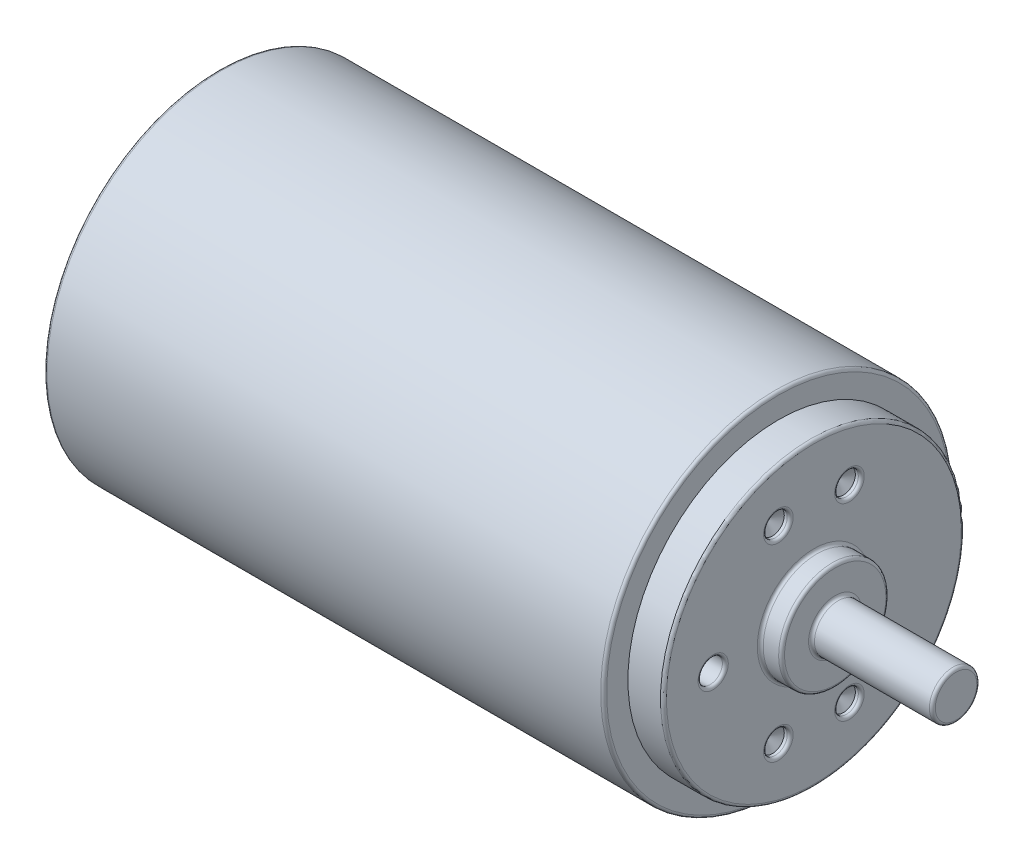
ISO-10303-21;
HEADER;
FILE_DESCRIPTION(('STEP AP214'),'2;1');
FILE_NAME('part.step','',(''),(''),'','','');
FILE_SCHEMA(('AUTOMOTIVE_DESIGN { 1 0 10303 214 1 1 1 1 }'));
ENDSEC;
DATA;
#1=APPLICATION_CONTEXT('core data for automotive mechanical design processes');
#2=APPLICATION_PROTOCOL_DEFINITION('international standard','automotive_design',2000,#1);
#3=PRODUCT_CONTEXT('',#1,'mechanical');
#4=PRODUCT('Part','Part','',(#3));
#5=PRODUCT_RELATED_PRODUCT_CATEGORY('part','',(#4));
#6=PRODUCT_DEFINITION_FORMATION('','',#4);
#7=PRODUCT_DEFINITION_CONTEXT('part definition',#1,'design');
#8=PRODUCT_DEFINITION('design','',#6,#7);
#9=PRODUCT_DEFINITION_SHAPE('','',#8);
#10=(LENGTH_UNIT() NAMED_UNIT(*) SI_UNIT(.MILLI.,.METRE.));
#11=(NAMED_UNIT(*) PLANE_ANGLE_UNIT() SI_UNIT($,.RADIAN.));
#12=(NAMED_UNIT(*) SI_UNIT($,.STERADIAN.) SOLID_ANGLE_UNIT());
#13=UNCERTAINTY_MEASURE_WITH_UNIT(LENGTH_MEASURE(1.E-05),#10,'distance_accuracy_value','');
#14=(GEOMETRIC_REPRESENTATION_CONTEXT(3) GLOBAL_UNCERTAINTY_ASSIGNED_CONTEXT((#13)) GLOBAL_UNIT_ASSIGNED_CONTEXT((#10,
#11,#12)) REPRESENTATION_CONTEXT('',''));
#15=CARTESIAN_POINT('',(0.,0.,0.));
#16=DIRECTION('',(0.,0.,1.));
#17=DIRECTION('',(1.,0.,0.));
#18=AXIS2_PLACEMENT_3D('',#15,#16,#17);
#19=CARTESIAN_POINT('',(-21.6511204199663,29.5,0.));
#20=DIRECTION('',(-1.,0.,0.));
#21=DIRECTION('',(0.,-1.,0.));
#22=AXIS2_PLACEMENT_3D('',#19,#20,#21);
#23=PLANE('',#22);
#24=CARTESIAN_POINT('',(-21.6511204199663,0.,0.));
#25=DIRECTION('',(-1.,0.,0.));
#26=DIRECTION('',(0.,-1.,0.));
#27=AXIS2_PLACEMENT_3D('',#24,#25,#26);
#28=CIRCLE('',#27,23.4496818018802);
#29=CARTESIAN_POINT('',(-21.6511204199663,-23.4496818018802,0.));
#30=VERTEX_POINT('',#29);
#31=EDGE_CURVE('E173',#30,#30,#28,.F.);
#32=ORIENTED_EDGE('',*,*,#31,.T.);
#33=EDGE_LOOP('',(#32));
#34=FACE_BOUND('',#33,.T.);
#35=CARTESIAN_POINT('',(-21.6511204199663,0.,0.));
#36=DIRECTION('',(-1.,0.,0.));
#37=DIRECTION('',(0.,-1.,0.));
#38=AXIS2_PLACEMENT_3D('',#35,#36,#37);
#39=CIRCLE('',#38,29.);
#40=CARTESIAN_POINT('',(-21.6511204199663,-29.,0.));
#41=VERTEX_POINT('',#40);
#42=EDGE_CURVE('E170',#41,#41,#39,.T.);
#43=ORIENTED_EDGE('',*,*,#42,.T.);
#44=EDGE_LOOP('',(#43));
#45=FACE_BOUND('',#44,.T.);
#46=ADVANCED_FACE('F41',(#34,#45),#23,.T.);
#47=CARTESIAN_POINT('',(0.,0.,0.));
#48=DIRECTION('',(1.,0.,0.));
#49=DIRECTION('',(0.,1.,0.));
#50=AXIS2_PLACEMENT_3D('',#47,#48,#49);
#51=CYLINDRICAL_SURFACE('',#50,22.9496818018802);
#52=CARTESIAN_POINT('',(-23.6911519728795,0.,0.));
#53=DIRECTION('',(-1.,0.,0.));
#54=DIRECTION('',(0.,-1.,0.));
#55=AXIS2_PLACEMENT_3D('',#52,#53,#54);
#56=CIRCLE('',#55,22.9496818018802);
#57=CARTESIAN_POINT('',(-23.6911519728795,-22.9496818018802,0.));
#58=VERTEX_POINT('',#57);
#59=EDGE_CURVE('E164',#58,#58,#56,.F.);
#60=ORIENTED_EDGE('',*,*,#59,.T.);
#61=EDGE_LOOP('',(#60));
#62=FACE_BOUND('',#61,.T.);
#63=CARTESIAN_POINT('',(-22.1511204199663,0.,0.));
#64=DIRECTION('',(-1.,0.,0.));
#65=DIRECTION('',(0.,-1.,0.));
#66=AXIS2_PLACEMENT_3D('',#63,#64,#65);
#67=CIRCLE('',#66,22.9496818018802);
#68=CARTESIAN_POINT('',(-22.1511204199663,-22.9496818018802,0.));
#69=VERTEX_POINT('',#68);
#70=EDGE_CURVE('E161',#69,#69,#67,.T.);
#71=ORIENTED_EDGE('',*,*,#70,.T.);
#72=EDGE_LOOP('',(#71));
#73=FACE_BOUND('',#72,.T.);
#74=ADVANCED_FACE('F200',(#62,#73),#51,.T.);
#75=CARTESIAN_POINT('',(-24.1911519728795,22.9496818018802,0.));
#76=DIRECTION('',(-1.,0.,0.));
#77=DIRECTION('',(0.,-1.,0.));
#78=AXIS2_PLACEMENT_3D('',#75,#76,#77);
#79=PLANE('',#78);
#80=CARTESIAN_POINT('',(-24.1911519728795,0.,0.));
#81=DIRECTION('',(-1.,0.,0.));
#82=DIRECTION('',(0.,-1.,0.));
#83=AXIS2_PLACEMENT_3D('',#80,#81,#82);
#84=CIRCLE('',#83,22.4496818018802);
#85=CARTESIAN_POINT('',(-24.1911519728795,-22.4496818018802,0.));
#86=VERTEX_POINT('',#85);
#87=EDGE_CURVE('E167',#86,#86,#84,.T.);
#88=ORIENTED_EDGE('',*,*,#87,.T.);
#89=EDGE_LOOP('',(#88));
#90=FACE_BOUND('',#89,.T.);
#91=CARTESIAN_POINT('',(-24.1911519728795,0.,0.));
#92=DIRECTION('',(1.,0.,0.));
#93=DIRECTION('',(0.,1.,0.));
#94=AXIS2_PLACEMENT_3D('',#91,#92,#93);
#95=CIRCLE('',#94,5.69335436860877);
#96=CARTESIAN_POINT('',(-24.1911519728795,5.69335436860877,0.));
#97=VERTEX_POINT('',#96);
#98=EDGE_CURVE('E95',#97,#97,#95,.T.);
#99=ORIENTED_EDGE('',*,*,#98,.T.);
#100=EDGE_LOOP('',(#99));
#101=FACE_BOUND('',#100,.T.);
#102=ADVANCED_FACE('F207',(#90,#101),#79,.T.);
#103=CARTESIAN_POINT('',(-24.1911519728795,0.,0.));
#104=DIRECTION('',(1.,0.,0.));
#105=DIRECTION('',(0.,1.,0.));
#106=AXIS2_PLACEMENT_3D('',#103,#104,#105);
#107=CONICAL_SURFACE('',#106,5.69335436860877,0.275071425127153);
#108=CARTESIAN_POINT('',(-30.1911519728795,0.,0.));
#109=DIRECTION('',(1.,0.,0.));
#110=DIRECTION('',(0.,1.,0.));
#111=AXIS2_PLACEMENT_3D('',#108,#109,#110);
#112=CIRCLE('',#111,4.);
#113=CARTESIAN_POINT('',(-30.1911519728795,4.,0.));
#114=VERTEX_POINT('',#113);
#115=EDGE_CURVE('E92',#114,#114,#112,.T.);
#116=ORIENTED_EDGE('',*,*,#115,.T.);
#117=EDGE_LOOP('',(#116));
#118=FACE_BOUND('',#117,.T.);
#119=ORIENTED_EDGE('',*,*,#98,.F.);
#120=EDGE_LOOP('',(#119));
#121=FACE_BOUND('',#120,.T.);
#122=ADVANCED_FACE('F518',(#118,#121),#107,.T.);
#123=CARTESIAN_POINT('',(0.,0.,0.));
#124=DIRECTION('',(1.,0.,0.));
#125=DIRECTION('',(0.,1.,0.));
#126=AXIS2_PLACEMENT_3D('',#123,#124,#125);
#127=CYLINDRICAL_SURFACE('',#126,4.);
#128=CARTESIAN_POINT('',(-38.6911519728795,0.,0.));
#129=DIRECTION('',(-1.,0.,0.));
#130=DIRECTION('',(0.,-1.,0.));
#131=AXIS2_PLACEMENT_3D('',#128,#129,#130);
#132=CIRCLE('',#131,4.);
#133=CARTESIAN_POINT('',(-38.6911519728795,-4.,0.));
#134=VERTEX_POINT('',#133);
#135=EDGE_CURVE('E155',#134,#134,#132,.F.);
#136=ORIENTED_EDGE('',*,*,#135,.T.);
#137=EDGE_LOOP('',(#136));
#138=FACE_BOUND('',#137,.T.);
#139=ORIENTED_EDGE('',*,*,#115,.F.);
#140=EDGE_LOOP('',(#139));
#141=FACE_BOUND('',#140,.T.);
#142=ADVANCED_FACE('F508',(#138,#141),#127,.T.);
#143=CARTESIAN_POINT('',(-39.1911519728795,4.,0.));
#144=DIRECTION('',(-1.,0.,0.));
#145=DIRECTION('',(0.,-1.,0.));
#146=AXIS2_PLACEMENT_3D('',#143,#144,#145);
#147=PLANE('',#146);
#148=CARTESIAN_POINT('',(-39.1911519728795,0.,0.));
#149=DIRECTION('',(-1.,0.,0.));
#150=DIRECTION('',(0.,-1.,0.));
#151=AXIS2_PLACEMENT_3D('',#148,#149,#150);
#152=CIRCLE('',#151,3.5);
#153=CARTESIAN_POINT('',(-39.1911519728795,-3.5,0.));
#154=VERTEX_POINT('',#153);
#155=EDGE_CURVE('E158',#154,#154,#152,.T.);
#156=ORIENTED_EDGE('',*,*,#155,.T.);
#157=EDGE_LOOP('',(#156));
#158=FACE_BOUND('',#157,.T.);
#159=ADVANCED_FACE('F499',(#158),#147,.T.);
#160=CARTESIAN_POINT('',(102.808848027121,4.,0.));
#161=DIRECTION('',(1.,0.,0.));
#162=DIRECTION('',(0.,1.,0.));
#163=AXIS2_PLACEMENT_3D('',#160,#161,#162);
#164=PLANE('',#163);
#165=CARTESIAN_POINT('',(102.808848027121,0.,0.));
#166=DIRECTION('',(1.,0.,0.));
#167=DIRECTION('',(0.,1.,0.));
#168=AXIS2_PLACEMENT_3D('',#165,#166,#167);
#169=CIRCLE('',#168,3.49999999999999);
#170=CARTESIAN_POINT('',(102.808848027121,3.5,0.));
#171=VERTEX_POINT('',#170);
#172=EDGE_CURVE('E49',#171,#171,#169,.T.);
#173=ORIENTED_EDGE('',*,*,#172,.T.);
#174=EDGE_LOOP('',(#173));
#175=FACE_BOUND('',#174,.T.);
#176=ADVANCED_FACE('F184',(#175),#164,.T.);
#177=CARTESIAN_POINT('',(0.,0.,0.));
#178=DIRECTION('',(1.,0.,0.));
#179=DIRECTION('',(0.,1.,0.));
#180=AXIS2_PLACEMENT_3D('',#177,#178,#179);
#181=CYLINDRICAL_SURFACE('',#180,3.99999999999999);
#182=CARTESIAN_POINT('',(82.9088480271205,0.,0.));
#183=DIRECTION('',(1.,0.,0.));
#184=DIRECTION('',(0.,1.,0.));
#185=AXIS2_PLACEMENT_3D('',#182,#183,#184);
#186=CIRCLE('',#185,3.99999999999999);
#187=CARTESIAN_POINT('',(82.9088480271205,4.,0.));
#188=VERTEX_POINT('',#187);
#189=EDGE_CURVE('E101',#188,#188,#186,.T.);
#190=ORIENTED_EDGE('',*,*,#189,.T.);
#191=EDGE_LOOP('',(#190));
#192=FACE_BOUND('',#191,.T.);
#193=CARTESIAN_POINT('',(102.308848027121,0.,0.));
#194=DIRECTION('',(1.,0.,0.));
#195=DIRECTION('',(0.,1.,0.));
#196=AXIS2_PLACEMENT_3D('',#193,#194,#195);
#197=CIRCLE('',#196,3.99999999999999);
#198=CARTESIAN_POINT('',(102.308848027121,4.,0.));
#199=VERTEX_POINT('',#198);
#200=EDGE_CURVE('E98',#199,#199,#197,.F.);
#201=ORIENTED_EDGE('',*,*,#200,.T.);
#202=EDGE_LOOP('',(#201));
#203=FACE_BOUND('',#202,.T.);
#204=ADVANCED_FACE('F479',(#192,#203),#181,.T.);
#205=CARTESIAN_POINT('',(82.4088480271205,9.05389907670637,0.));
#206=DIRECTION('',(1.,0.,0.));
#207=DIRECTION('',(0.,1.,0.));
#208=AXIS2_PLACEMENT_3D('',#205,#206,#207);
#209=PLANE('',#208);
#210=CARTESIAN_POINT('',(82.4088480271205,0.,0.));
#211=DIRECTION('',(1.,0.,0.));
#212=DIRECTION('',(0.,1.,0.));
#213=AXIS2_PLACEMENT_3D('',#210,#211,#212);
#214=CIRCLE('',#213,4.49999999999999);
#215=CARTESIAN_POINT('',(82.4088480271205,4.5,0.));
#216=VERTEX_POINT('',#215);
#217=EDGE_CURVE('E107',#216,#216,#214,.F.);
#218=ORIENTED_EDGE('',*,*,#217,.T.);
#219=EDGE_LOOP('',(#218));
#220=FACE_BOUND('',#219,.T.);
#221=CARTESIAN_POINT('',(82.4088480271205,0.,0.));
#222=DIRECTION('',(1.,0.,0.));
#223=DIRECTION('',(0.,1.,0.));
#224=AXIS2_PLACEMENT_3D('',#221,#222,#223);
#225=CIRCLE('',#224,8.55389907670636);
#226=CARTESIAN_POINT('',(82.4088480271205,8.55389907670637,0.));
#227=VERTEX_POINT('',#226);
#228=EDGE_CURVE('E104',#227,#227,#225,.T.);
#229=ORIENTED_EDGE('',*,*,#228,.T.);
#230=EDGE_LOOP('',(#229));
#231=FACE_BOUND('',#230,.T.);
#232=ADVANCED_FACE('F470',(#220,#231),#209,.T.);
#233=CARTESIAN_POINT('',(0.,0.,0.));
#234=DIRECTION('',(1.,0.,0.));
#235=DIRECTION('',(0.,1.,0.));
#236=AXIS2_PLACEMENT_3D('',#233,#234,#235);
#237=CYLINDRICAL_SURFACE('',#236,9.05389907670636);
#238=CARTESIAN_POINT('',(81.9088480271205,0.,0.));
#239=DIRECTION('',(1.,0.,0.));
#240=DIRECTION('',(0.,1.,0.));
#241=AXIS2_PLACEMENT_3D('',#238,#239,#240);
#242=CIRCLE('',#241,9.05389907670636);
#243=CARTESIAN_POINT('',(81.9088480271205,9.05389907670637,0.));
#244=VERTEX_POINT('',#243);
#245=EDGE_CURVE('E113',#244,#244,#242,.F.);
#246=ORIENTED_EDGE('',*,*,#245,.T.);
#247=EDGE_LOOP('',(#246));
#248=FACE_BOUND('',#247,.T.);
#249=CARTESIAN_POINT('',(79.3088480271205,0.,0.));
#250=DIRECTION('',(1.,0.,0.));
#251=DIRECTION('',(0.,1.,0.));
#252=AXIS2_PLACEMENT_3D('',#249,#250,#251);
#253=CIRCLE('',#252,9.05389907670636);
#254=CARTESIAN_POINT('',(79.3088480271205,9.05389907670637,0.));
#255=VERTEX_POINT('',#254);
#256=EDGE_CURVE('E110',#255,#255,#253,.T.);
#257=ORIENTED_EDGE('',*,*,#256,.T.);
#258=EDGE_LOOP('',(#257));
#259=FACE_BOUND('',#258,.T.);
#260=ADVANCED_FACE('F461',(#248,#259),#237,.T.);
#261=CARTESIAN_POINT('',(78.8088480271205,25.3975656614744,0.));
#262=DIRECTION('',(1.,0.,0.));
#263=DIRECTION('',(0.,1.,0.));
#264=AXIS2_PLACEMENT_3D('',#261,#262,#263);
#265=PLANE('',#264);
#266=CARTESIAN_POINT('',(78.8088480271205,0.,0.));
#267=DIRECTION('',(1.,0.,0.));
#268=DIRECTION('',(0.,1.,0.));
#269=AXIS2_PLACEMENT_3D('',#266,#267,#268);
#270=CIRCLE('',#269,9.55389907670637);
#271=CARTESIAN_POINT('',(78.8088480271205,9.55389907670637,0.));
#272=VERTEX_POINT('',#271);
#273=EDGE_CURVE('E134',#272,#272,#270,.F.);
#274=ORIENTED_EDGE('',*,*,#273,.T.);
#275=EDGE_LOOP('',(#274));
#276=FACE_BOUND('',#275,.T.);
#277=CARTESIAN_POINT('',(78.8088480271205,0.,0.));
#278=DIRECTION('',(1.,0.,0.));
#279=DIRECTION('',(0.,1.,0.));
#280=AXIS2_PLACEMENT_3D('',#277,#278,#279);
#281=CIRCLE('',#280,24.8975656614744);
#282=CARTESIAN_POINT('',(78.8088480271205,24.8975656614744,0.));
#283=VERTEX_POINT('',#282);
#284=EDGE_CURVE('E131',#283,#283,#281,.T.);
#285=ORIENTED_EDGE('',*,*,#284,.T.);
#286=EDGE_LOOP('',(#285));
#287=FACE_BOUND('',#286,.T.);
#288=CARTESIAN_POINT('',(78.8088480271205,-15.9059737205869,-6.));
#289=DIRECTION('',(1.,0.,0.));
#290=DIRECTION('',(0.,1.,0.));
#291=AXIS2_PLACEMENT_3D('',#288,#289,#290);
#292=CIRCLE('',#291,2.5);
#293=CARTESIAN_POINT('',(78.8088480271205,-13.4059737205869,-6.));
#294=VERTEX_POINT('',#293);
#295=EDGE_CURVE('E128',#294,#294,#292,.F.);
#296=ORIENTED_EDGE('',*,*,#295,.T.);
#297=EDGE_LOOP('',(#296));
#298=FACE_BOUND('',#297,.T.);
#299=CARTESIAN_POINT('',(78.8088480271205,-15.9059737205869,6.));
#300=DIRECTION('',(1.,0.,0.));
#301=DIRECTION('',(0.,1.,0.));
#302=AXIS2_PLACEMENT_3D('',#299,#300,#301);
#303=CIRCLE('',#302,2.5);
#304=CARTESIAN_POINT('',(78.8088480271205,-13.4059737205869,6.));
#305=VERTEX_POINT('',#304);
#306=EDGE_CURVE('E125',#305,#305,#303,.F.);
#307=ORIENTED_EDGE('',*,*,#306,.T.);
#308=EDGE_LOOP('',(#307));
#309=FACE_BOUND('',#308,.T.);
#310=CARTESIAN_POINT('',(78.8088480271205,15.9059737205869,-6.));
#311=DIRECTION('',(1.,0.,0.));
#312=DIRECTION('',(0.,1.,0.));
#313=AXIS2_PLACEMENT_3D('',#310,#311,#312);
#314=CIRCLE('',#313,2.5);
#315=CARTESIAN_POINT('',(78.8088480271205,18.4059737205869,-6.));
#316=VERTEX_POINT('',#315);
#317=EDGE_CURVE('E122',#316,#316,#314,.F.);
#318=ORIENTED_EDGE('',*,*,#317,.T.);
#319=EDGE_LOOP('',(#318));
#320=FACE_BOUND('',#319,.T.);
#321=CARTESIAN_POINT('',(78.8088480271205,15.9059737205869,6.));
#322=DIRECTION('',(1.,0.,0.));
#323=DIRECTION('',(0.,1.,0.));
#324=AXIS2_PLACEMENT_3D('',#321,#322,#323);
#325=CIRCLE('',#324,2.5);
#326=CARTESIAN_POINT('',(78.8088480271205,18.4059737205869,6.));
#327=VERTEX_POINT('',#326);
#328=EDGE_CURVE('E119',#327,#327,#325,.F.);
#329=ORIENTED_EDGE('',*,*,#328,.T.);
#330=EDGE_LOOP('',(#329));
#331=FACE_BOUND('',#330,.T.);
#332=CARTESIAN_POINT('',(78.8088480271205,0.,17.));
#333=DIRECTION('',(1.,0.,0.));
#334=DIRECTION('',(0.,1.,0.));
#335=AXIS2_PLACEMENT_3D('',#332,#333,#334);
#336=CIRCLE('',#335,2.55);
#337=CARTESIAN_POINT('',(78.8088480271205,2.55,17.));
#338=VERTEX_POINT('',#337);
#339=EDGE_CURVE('E116',#338,#338,#336,.F.);
#340=ORIENTED_EDGE('',*,*,#339,.T.);
#341=EDGE_LOOP('',(#340));
#342=FACE_BOUND('',#341,.T.);
#343=ADVANCED_FACE('F452',(#276,#287,#298,#309,#320,#331,#342),#265,.T.);
#344=CARTESIAN_POINT('',(0.,0.,0.));
#345=DIRECTION('',(1.,0.,0.));
#346=DIRECTION('',(0.,1.,0.));
#347=AXIS2_PLACEMENT_3D('',#344,#345,#346);
#348=CYLINDRICAL_SURFACE('',#347,25.3975656614744);
#349=CARTESIAN_POINT('',(78.3088480271205,0.,0.));
#350=DIRECTION('',(1.,0.,0.));
#351=DIRECTION('',(0.,1.,0.));
#352=AXIS2_PLACEMENT_3D('',#349,#350,#351);
#353=CIRCLE('',#352,25.3975656614744);
#354=CARTESIAN_POINT('',(78.3088480271205,25.3975656614744,0.));
#355=VERTEX_POINT('',#354);
#356=EDGE_CURVE('E137',#355,#355,#353,.F.);
#357=ORIENTED_EDGE('',*,*,#356,.T.);
#358=EDGE_LOOP('',(#357));
#359=FACE_BOUND('',#358,.T.);
#360=CARTESIAN_POINT('',(72.8088480271205,0.,0.));
#361=DIRECTION('',(1.,0.,0.));
#362=DIRECTION('',(0.,1.,0.));
#363=AXIS2_PLACEMENT_3D('',#360,#361,#362);
#364=CIRCLE('',#363,25.3975656614744);
#365=CARTESIAN_POINT('',(72.8088480271205,25.3975656614744,0.));
#366=VERTEX_POINT('',#365);
#367=EDGE_CURVE('E89',#366,#366,#364,.T.);
#368=ORIENTED_EDGE('',*,*,#367,.T.);
#369=EDGE_LOOP('',(#368));
#370=FACE_BOUND('',#369,.T.);
#371=ADVANCED_FACE('F443',(#359,#370),#348,.T.);
#372=CARTESIAN_POINT('',(72.8088480271205,29.5,0.));
#373=DIRECTION('',(1.,0.,0.));
#374=DIRECTION('',(0.,1.,0.));
#375=AXIS2_PLACEMENT_3D('',#372,#373,#374);
#376=PLANE('',#375);
#377=CARTESIAN_POINT('',(72.8088480271205,0.,0.));
#378=DIRECTION('',(1.,0.,0.));
#379=DIRECTION('',(0.,1.,0.));
#380=AXIS2_PLACEMENT_3D('',#377,#378,#379);
#381=CIRCLE('',#380,29.);
#382=CARTESIAN_POINT('',(72.8088480271205,29.,0.));
#383=VERTEX_POINT('',#382);
#384=EDGE_CURVE('E11',#383,#383,#381,.T.);
#385=ORIENTED_EDGE('',*,*,#384,.T.);
#386=EDGE_LOOP('',(#385));
#387=FACE_BOUND('',#386,.T.);
#388=ORIENTED_EDGE('',*,*,#367,.F.);
#389=EDGE_LOOP('',(#388));
#390=FACE_BOUND('',#389,.T.);
#391=ADVANCED_FACE('F434',(#387,#390),#376,.T.);
#392=CARTESIAN_POINT('',(0.,0.,0.));
#393=DIRECTION('',(1.,0.,0.));
#394=DIRECTION('',(0.,1.,0.));
#395=AXIS2_PLACEMENT_3D('',#392,#393,#394);
#396=CYLINDRICAL_SURFACE('',#395,29.5);
#397=CARTESIAN_POINT('',(-21.1511204199663,0.,0.));
#398=DIRECTION('',(-1.,0.,0.));
#399=DIRECTION('',(0.,-1.,0.));
#400=AXIS2_PLACEMENT_3D('',#397,#398,#399);
#401=CIRCLE('',#400,29.5);
#402=CARTESIAN_POINT('',(-21.1511204199663,-29.5,0.));
#403=VERTEX_POINT('',#402);
#404=EDGE_CURVE('E179',#403,#403,#401,.F.);
#405=ORIENTED_EDGE('',*,*,#404,.T.);
#406=EDGE_LOOP('',(#405));
#407=FACE_BOUND('',#406,.T.);
#408=CARTESIAN_POINT('',(72.3088480271205,0.,0.));
#409=DIRECTION('',(1.,0.,0.));
#410=DIRECTION('',(0.,1.,0.));
#411=AXIS2_PLACEMENT_3D('',#408,#409,#410);
#412=CIRCLE('',#411,29.5);
#413=CARTESIAN_POINT('',(72.3088480271205,29.5,0.));
#414=VERTEX_POINT('',#413);
#415=EDGE_CURVE('E176',#414,#414,#412,.F.);
#416=ORIENTED_EDGE('',*,*,#415,.T.);
#417=EDGE_LOOP('',(#416));
#418=FACE_BOUND('',#417,.T.);
#419=ADVANCED_FACE('F425',(#407,#418),#396,.T.);
#420=CARTESIAN_POINT('',(77.8088480271205,-15.9059737205869,-6.));
#421=DIRECTION('',(1.,0.,0.));
#422=DIRECTION('',(0.,0.,-1.));
#423=AXIS2_PLACEMENT_3D('',#420,#421,#422);
#424=CONICAL_SURFACE('',#423,2.,1.02974425867665);
#425=CARTESIAN_POINT('',(76.6071267890654,-15.9059737205869,-6.));
#426=VERTEX_POINT('',#425);
#427=VERTEX_LOOP('',#426);
#428=FACE_BOUND('',#427,.T.);
#429=CARTESIAN_POINT('',(77.8088480271205,-15.9059737205869,-6.));
#430=DIRECTION('',(1.,0.,0.));
#431=DIRECTION('',(0.,0.,-1.));
#432=AXIS2_PLACEMENT_3D('',#429,#430,#431);
#433=CIRCLE('',#432,2.);
#434=CARTESIAN_POINT('',(77.8088480271205,-15.9059737205869,-8.));
#435=VERTEX_POINT('',#434);
#436=EDGE_CURVE('E86',#435,#435,#433,.T.);
#437=ORIENTED_EDGE('',*,*,#436,.T.);
#438=EDGE_LOOP('',(#437));
#439=FACE_BOUND('',#438,.T.);
#440=ADVANCED_FACE('F416',(#428,#439),#424,.F.);
#441=CARTESIAN_POINT('',(78.8088480271205,-15.9059737205869,-6.));
#442=DIRECTION('',(1.,0.,0.));
#443=DIRECTION('',(0.,0.,-1.));
#444=AXIS2_PLACEMENT_3D('',#441,#442,#443);
#445=CYLINDRICAL_SURFACE('',#444,2.);
#446=CARTESIAN_POINT('',(78.3088480271205,-15.9059737205869,-6.));
#447=DIRECTION('',(1.,0.,0.));
#448=DIRECTION('',(0.,1.,0.));
#449=AXIS2_PLACEMENT_3D('',#446,#447,#448);
#450=CIRCLE('',#449,2.);
#451=CARTESIAN_POINT('',(78.3088480271205,-13.9059737205869,-6.));
#452=VERTEX_POINT('',#451);
#453=EDGE_CURVE('E140',#452,#452,#450,.T.);
#454=ORIENTED_EDGE('',*,*,#453,.T.);
#455=EDGE_LOOP('',(#454));
#456=FACE_BOUND('',#455,.T.);
#457=ORIENTED_EDGE('',*,*,#436,.F.);
#458=EDGE_LOOP('',(#457));
#459=FACE_BOUND('',#458,.T.);
#460=ADVANCED_FACE('F407',(#456,#459),#445,.F.);
#461=CARTESIAN_POINT('',(77.8088480271205,-15.9059737205869,6.));
#462=DIRECTION('',(1.,0.,0.));
#463=DIRECTION('',(0.,0.,-1.));
#464=AXIS2_PLACEMENT_3D('',#461,#462,#463);
#465=CONICAL_SURFACE('',#464,2.,1.02974425867665);
#466=CARTESIAN_POINT('',(76.6071267890654,-15.9059737205869,6.));
#467=VERTEX_POINT('',#466);
#468=VERTEX_LOOP('',#467);
#469=FACE_BOUND('',#468,.T.);
#470=CARTESIAN_POINT('',(77.8088480271205,-15.9059737205869,6.));
#471=DIRECTION('',(1.,0.,0.));
#472=DIRECTION('',(0.,0.,-1.));
#473=AXIS2_PLACEMENT_3D('',#470,#471,#472);
#474=CIRCLE('',#473,2.);
#475=CARTESIAN_POINT('',(77.8088480271205,-15.9059737205869,4.));
#476=VERTEX_POINT('',#475);
#477=EDGE_CURVE('E83',#476,#476,#474,.T.);
#478=ORIENTED_EDGE('',*,*,#477,.T.);
#479=EDGE_LOOP('',(#478));
#480=FACE_BOUND('',#479,.T.);
#481=ADVANCED_FACE('F398',(#469,#480),#465,.F.);
#482=CARTESIAN_POINT('',(78.8088480271205,-15.9059737205869,6.));
#483=DIRECTION('',(1.,0.,0.));
#484=DIRECTION('',(0.,0.,-1.));
#485=AXIS2_PLACEMENT_3D('',#482,#483,#484);
#486=CYLINDRICAL_SURFACE('',#485,2.);
#487=CARTESIAN_POINT('',(78.3088480271205,-15.9059737205869,6.));
#488=DIRECTION('',(1.,0.,0.));
#489=DIRECTION('',(0.,1.,0.));
#490=AXIS2_PLACEMENT_3D('',#487,#488,#489);
#491=CIRCLE('',#490,2.);
#492=CARTESIAN_POINT('',(78.3088480271205,-13.9059737205869,6.));
#493=VERTEX_POINT('',#492);
#494=EDGE_CURVE('E143',#493,#493,#491,.T.);
#495=ORIENTED_EDGE('',*,*,#494,.T.);
#496=EDGE_LOOP('',(#495));
#497=FACE_BOUND('',#496,.T.);
#498=ORIENTED_EDGE('',*,*,#477,.F.);
#499=EDGE_LOOP('',(#498));
#500=FACE_BOUND('',#499,.T.);
#501=ADVANCED_FACE('F388',(#497,#500),#486,.F.);
#502=CARTESIAN_POINT('',(77.8088480271205,15.9059737205869,-6.));
#503=DIRECTION('',(1.,0.,0.));
#504=DIRECTION('',(0.,0.,-1.));
#505=AXIS2_PLACEMENT_3D('',#502,#503,#504);
#506=CONICAL_SURFACE('',#505,2.,1.02974425867666);
#507=CARTESIAN_POINT('',(76.6071267890654,15.9059737205869,-6.));
#508=VERTEX_POINT('',#507);
#509=VERTEX_LOOP('',#508);
#510=FACE_BOUND('',#509,.T.);
#511=CARTESIAN_POINT('',(77.8088480271205,15.9059737205869,-6.));
#512=DIRECTION('',(1.,0.,0.));
#513=DIRECTION('',(0.,0.,-1.));
#514=AXIS2_PLACEMENT_3D('',#511,#512,#513);
#515=CIRCLE('',#514,2.);
#516=CARTESIAN_POINT('',(77.8088480271205,15.9059737205869,-8.));
#517=VERTEX_POINT('',#516);
#518=EDGE_CURVE('E78',#517,#517,#515,.T.);
#519=ORIENTED_EDGE('',*,*,#518,.T.);
#520=EDGE_LOOP('',(#519));
#521=FACE_BOUND('',#520,.T.);
#522=ADVANCED_FACE('F379',(#510,#521),#506,.F.);
#523=CARTESIAN_POINT('',(78.8088480271205,15.9059737205869,-6.));
#524=DIRECTION('',(1.,0.,0.));
#525=DIRECTION('',(0.,0.,-1.));
#526=AXIS2_PLACEMENT_3D('',#523,#524,#525);
#527=CYLINDRICAL_SURFACE('',#526,2.);
#528=CARTESIAN_POINT('',(78.3088480271205,15.9059737205869,-6.));
#529=DIRECTION('',(1.,0.,0.));
#530=DIRECTION('',(0.,1.,0.));
#531=AXIS2_PLACEMENT_3D('',#528,#529,#530);
#532=CIRCLE('',#531,2.);
#533=CARTESIAN_POINT('',(78.3088480271205,17.9059737205869,-6.));
#534=VERTEX_POINT('',#533);
#535=EDGE_CURVE('E146',#534,#534,#532,.T.);
#536=ORIENTED_EDGE('',*,*,#535,.T.);
#537=EDGE_LOOP('',(#536));
#538=FACE_BOUND('',#537,.T.);
#539=ORIENTED_EDGE('',*,*,#518,.F.);
#540=EDGE_LOOP('',(#539));
#541=FACE_BOUND('',#540,.T.);
#542=ADVANCED_FACE('F369',(#538,#541),#527,.F.);
#543=CARTESIAN_POINT('',(77.8088480271205,15.9059737205869,6.));
#544=DIRECTION('',(1.,0.,0.));
#545=DIRECTION('',(0.,0.,-1.));
#546=AXIS2_PLACEMENT_3D('',#543,#544,#545);
#547=CONICAL_SURFACE('',#546,2.,1.02974425867666);
#548=CARTESIAN_POINT('',(76.6071267890654,15.9059737205869,6.));
#549=VERTEX_POINT('',#548);
#550=VERTEX_LOOP('',#549);
#551=FACE_BOUND('',#550,.T.);
#552=CARTESIAN_POINT('',(77.8088480271205,15.9059737205869,6.));
#553=DIRECTION('',(1.,0.,0.));
#554=DIRECTION('',(0.,0.,-1.));
#555=AXIS2_PLACEMENT_3D('',#552,#553,#554);
#556=CIRCLE('',#555,2.);
#557=CARTESIAN_POINT('',(77.8088480271205,15.9059737205869,4.));
#558=VERTEX_POINT('',#557);
#559=EDGE_CURVE('E75',#558,#558,#556,.T.);
#560=ORIENTED_EDGE('',*,*,#559,.T.);
#561=EDGE_LOOP('',(#560));
#562=FACE_BOUND('',#561,.T.);
#563=ADVANCED_FACE('F360',(#551,#562),#547,.F.);
#564=CARTESIAN_POINT('',(78.8088480271205,15.9059737205869,6.));
#565=DIRECTION('',(1.,0.,0.));
#566=DIRECTION('',(0.,0.,-1.));
#567=AXIS2_PLACEMENT_3D('',#564,#565,#566);
#568=CYLINDRICAL_SURFACE('',#567,2.);
#569=CARTESIAN_POINT('',(78.3088480271205,15.9059737205869,6.));
#570=DIRECTION('',(1.,0.,0.));
#571=DIRECTION('',(0.,1.,0.));
#572=AXIS2_PLACEMENT_3D('',#569,#570,#571);
#573=CIRCLE('',#572,2.);
#574=CARTESIAN_POINT('',(78.3088480271205,17.9059737205869,6.));
#575=VERTEX_POINT('',#574);
#576=EDGE_CURVE('E149',#575,#575,#573,.T.);
#577=ORIENTED_EDGE('',*,*,#576,.T.);
#578=EDGE_LOOP('',(#577));
#579=FACE_BOUND('',#578,.T.);
#580=ORIENTED_EDGE('',*,*,#559,.F.);
#581=EDGE_LOOP('',(#580));
#582=FACE_BOUND('',#581,.T.);
#583=ADVANCED_FACE('F69',(#579,#582),#568,.F.);
#584=CARTESIAN_POINT('',(67.3088480271205,0.,17.));
#585=DIRECTION('',(1.,0.,0.));
#586=DIRECTION('',(0.,0.,-1.));
#587=AXIS2_PLACEMENT_3D('',#584,#585,#586);
#588=CONICAL_SURFACE('',#587,2.05,1.02974425867665);
#589=CARTESIAN_POINT('',(66.077083758114,0.,17.));
#590=VERTEX_POINT('',#589);
#591=VERTEX_LOOP('',#590);
#592=FACE_BOUND('',#591,.T.);
#593=CARTESIAN_POINT('',(67.3088480271205,0.,17.));
#594=DIRECTION('',(1.,0.,0.));
#595=DIRECTION('',(0.,0.,-1.));
#596=AXIS2_PLACEMENT_3D('',#593,#594,#595);
#597=CIRCLE('',#596,2.05);
#598=CARTESIAN_POINT('',(67.3088480271205,0.,14.95));
#599=VERTEX_POINT('',#598);
#600=EDGE_CURVE('E73',#599,#599,#597,.T.);
#601=ORIENTED_EDGE('',*,*,#600,.T.);
#602=EDGE_LOOP('',(#601));
#603=FACE_BOUND('',#602,.T.);
#604=ADVANCED_FACE('F65',(#592,#603),#588,.F.);
#605=CARTESIAN_POINT('',(78.8088480271205,0.,17.));
#606=DIRECTION('',(1.,0.,0.));
#607=DIRECTION('',(0.,0.,-1.));
#608=AXIS2_PLACEMENT_3D('',#605,#606,#607);
#609=CYLINDRICAL_SURFACE('',#608,2.05);
#610=CARTESIAN_POINT('',(78.3088480271205,0.,17.));
#611=DIRECTION('',(1.,0.,0.));
#612=DIRECTION('',(0.,1.,0.));
#613=AXIS2_PLACEMENT_3D('',#610,#611,#612);
#614=CIRCLE('',#613,2.05);
#615=CARTESIAN_POINT('',(78.3088480271205,2.05,17.));
#616=VERTEX_POINT('',#615);
#617=EDGE_CURVE('E152',#616,#616,#614,.T.);
#618=ORIENTED_EDGE('',*,*,#617,.T.);
#619=EDGE_LOOP('',(#618));
#620=FACE_BOUND('',#619,.T.);
#621=ORIENTED_EDGE('',*,*,#600,.F.);
#622=EDGE_LOOP('',(#621));
#623=FACE_BOUND('',#622,.T.);
#624=ADVANCED_FACE('F68',(#620,#623),#609,.F.);
#625=CARTESIAN_POINT('',(82.9088480271205,0.,0.));
#626=DIRECTION('',(1.,0.,0.));
#627=DIRECTION('',(0.,1.,0.));
#628=AXIS2_PLACEMENT_3D('',#625,#626,#627);
#629=TOROIDAL_SURFACE('',#628,4.49999999999999,0.5);
#630=ORIENTED_EDGE('',*,*,#217,.F.);
#631=EDGE_LOOP('',(#630));
#632=FACE_BOUND('',#631,.T.);
#633=ORIENTED_EDGE('',*,*,#189,.F.);
#634=EDGE_LOOP('',(#633));
#635=FACE_BOUND('',#634,.T.);
#636=ADVANCED_FACE('F213',(#632,#635),#629,.F.);
#637=CARTESIAN_POINT('',(81.9088480271205,0.,0.));
#638=DIRECTION('',(1.,0.,0.));
#639=DIRECTION('',(0.,1.,0.));
#640=AXIS2_PLACEMENT_3D('',#637,#638,#639);
#641=TOROIDAL_SURFACE('',#640,8.55389907670636,0.5);
#642=ORIENTED_EDGE('',*,*,#245,.F.);
#643=EDGE_LOOP('',(#642));
#644=FACE_BOUND('',#643,.T.);
#645=ORIENTED_EDGE('',*,*,#228,.F.);
#646=EDGE_LOOP('',(#645));
#647=FACE_BOUND('',#646,.T.);
#648=ADVANCED_FACE('F216',(#644,#647),#641,.T.);
#649=CARTESIAN_POINT('',(79.3088480271205,0.,0.));
#650=DIRECTION('',(1.,0.,0.));
#651=DIRECTION('',(0.,1.,0.));
#652=AXIS2_PLACEMENT_3D('',#649,#650,#651);
#653=TOROIDAL_SURFACE('',#652,9.55389907670637,0.5);
#654=ORIENTED_EDGE('',*,*,#273,.F.);
#655=EDGE_LOOP('',(#654));
#656=FACE_BOUND('',#655,.T.);
#657=ORIENTED_EDGE('',*,*,#256,.F.);
#658=EDGE_LOOP('',(#657));
#659=FACE_BOUND('',#658,.T.);
#660=ADVANCED_FACE('F220',(#656,#659),#653,.F.);
#661=CARTESIAN_POINT('',(78.3088480271205,0.,0.));
#662=DIRECTION('',(1.,0.,0.));
#663=DIRECTION('',(0.,1.,0.));
#664=AXIS2_PLACEMENT_3D('',#661,#662,#663);
#665=TOROIDAL_SURFACE('',#664,24.8975656614744,0.5);
#666=ORIENTED_EDGE('',*,*,#356,.F.);
#667=EDGE_LOOP('',(#666));
#668=FACE_BOUND('',#667,.T.);
#669=ORIENTED_EDGE('',*,*,#284,.F.);
#670=EDGE_LOOP('',(#669));
#671=FACE_BOUND('',#670,.T.);
#672=ADVANCED_FACE('F224',(#668,#671),#665,.T.);
#673=CARTESIAN_POINT('',(78.3088480271205,-15.9059737205869,-6.));
#674=DIRECTION('',(1.,0.,0.));
#675=DIRECTION('',(0.,1.,0.));
#676=AXIS2_PLACEMENT_3D('',#673,#674,#675);
#677=TOROIDAL_SURFACE('',#676,2.5,0.5);
#678=ORIENTED_EDGE('',*,*,#295,.F.);
#679=EDGE_LOOP('',(#678));
#680=FACE_BOUND('',#679,.T.);
#681=ORIENTED_EDGE('',*,*,#453,.F.);
#682=EDGE_LOOP('',(#681));
#683=FACE_BOUND('',#682,.T.);
#684=ADVANCED_FACE('F228',(#680,#683),#677,.T.);
#685=CARTESIAN_POINT('',(78.3088480271205,-15.9059737205869,6.));
#686=DIRECTION('',(1.,0.,0.));
#687=DIRECTION('',(0.,1.,0.));
#688=AXIS2_PLACEMENT_3D('',#685,#686,#687);
#689=TOROIDAL_SURFACE('',#688,2.5,0.5);
#690=ORIENTED_EDGE('',*,*,#306,.F.);
#691=EDGE_LOOP('',(#690));
#692=FACE_BOUND('',#691,.T.);
#693=ORIENTED_EDGE('',*,*,#494,.F.);
#694=EDGE_LOOP('',(#693));
#695=FACE_BOUND('',#694,.T.);
#696=ADVANCED_FACE('F232',(#692,#695),#689,.T.);
#697=CARTESIAN_POINT('',(78.3088480271205,15.9059737205869,-6.));
#698=DIRECTION('',(1.,0.,0.));
#699=DIRECTION('',(0.,1.,0.));
#700=AXIS2_PLACEMENT_3D('',#697,#698,#699);
#701=TOROIDAL_SURFACE('',#700,2.5,0.5);
#702=ORIENTED_EDGE('',*,*,#317,.F.);
#703=EDGE_LOOP('',(#702));
#704=FACE_BOUND('',#703,.T.);
#705=ORIENTED_EDGE('',*,*,#535,.F.);
#706=EDGE_LOOP('',(#705));
#707=FACE_BOUND('',#706,.T.);
#708=ADVANCED_FACE('F236',(#704,#707),#701,.T.);
#709=CARTESIAN_POINT('',(78.3088480271205,15.9059737205869,6.));
#710=DIRECTION('',(1.,0.,0.));
#711=DIRECTION('',(0.,1.,0.));
#712=AXIS2_PLACEMENT_3D('',#709,#710,#711);
#713=TOROIDAL_SURFACE('',#712,2.5,0.5);
#714=ORIENTED_EDGE('',*,*,#328,.F.);
#715=EDGE_LOOP('',(#714));
#716=FACE_BOUND('',#715,.T.);
#717=ORIENTED_EDGE('',*,*,#576,.F.);
#718=EDGE_LOOP('',(#717));
#719=FACE_BOUND('',#718,.T.);
#720=ADVANCED_FACE('F240',(#716,#719),#713,.T.);
#721=CARTESIAN_POINT('',(78.3088480271205,0.,17.));
#722=DIRECTION('',(1.,0.,0.));
#723=DIRECTION('',(0.,1.,0.));
#724=AXIS2_PLACEMENT_3D('',#721,#722,#723);
#725=TOROIDAL_SURFACE('',#724,2.55,0.5);
#726=ORIENTED_EDGE('',*,*,#339,.F.);
#727=EDGE_LOOP('',(#726));
#728=FACE_BOUND('',#727,.T.);
#729=ORIENTED_EDGE('',*,*,#617,.F.);
#730=EDGE_LOOP('',(#729));
#731=FACE_BOUND('',#730,.T.);
#732=ADVANCED_FACE('F244',(#728,#731),#725,.T.);
#733=CARTESIAN_POINT('',(-38.6911519728795,0.,0.));
#734=DIRECTION('',(-1.,0.,0.));
#735=DIRECTION('',(0.,-1.,0.));
#736=AXIS2_PLACEMENT_3D('',#733,#734,#735);
#737=TOROIDAL_SURFACE('',#736,3.5,0.5);
#738=ORIENTED_EDGE('',*,*,#155,.F.);
#739=EDGE_LOOP('',(#738));
#740=FACE_BOUND('',#739,.T.);
#741=ORIENTED_EDGE('',*,*,#135,.F.);
#742=EDGE_LOOP('',(#741));
#743=FACE_BOUND('',#742,.T.);
#744=ADVANCED_FACE('F248',(#740,#743),#737,.T.);
#745=CARTESIAN_POINT('',(-23.6911519728795,0.,0.));
#746=DIRECTION('',(-1.,0.,0.));
#747=DIRECTION('',(0.,-1.,0.));
#748=AXIS2_PLACEMENT_3D('',#745,#746,#747);
#749=TOROIDAL_SURFACE('',#748,22.4496818018802,0.5);
#750=ORIENTED_EDGE('',*,*,#87,.F.);
#751=EDGE_LOOP('',(#750));
#752=FACE_BOUND('',#751,.T.);
#753=ORIENTED_EDGE('',*,*,#59,.F.);
#754=EDGE_LOOP('',(#753));
#755=FACE_BOUND('',#754,.T.);
#756=ADVANCED_FACE('F252',(#752,#755),#749,.T.);
#757=CARTESIAN_POINT('',(-22.1511204199663,0.,0.));
#758=DIRECTION('',(-1.,0.,0.));
#759=DIRECTION('',(0.,-1.,0.));
#760=AXIS2_PLACEMENT_3D('',#757,#758,#759);
#761=TOROIDAL_SURFACE('',#760,23.4496818018802,0.5);
#762=ORIENTED_EDGE('',*,*,#70,.F.);
#763=EDGE_LOOP('',(#762));
#764=FACE_BOUND('',#763,.T.);
#765=ORIENTED_EDGE('',*,*,#31,.F.);
#766=EDGE_LOOP('',(#765));
#767=FACE_BOUND('',#766,.T.);
#768=ADVANCED_FACE('F195',(#764,#767),#761,.F.);
#769=CARTESIAN_POINT('',(-21.1511204199663,0.,0.));
#770=DIRECTION('',(-1.,0.,0.));
#771=DIRECTION('',(0.,-1.,0.));
#772=AXIS2_PLACEMENT_3D('',#769,#770,#771);
#773=TOROIDAL_SURFACE('',#772,29.,0.5);
#774=ORIENTED_EDGE('',*,*,#42,.F.);
#775=EDGE_LOOP('',(#774));
#776=FACE_BOUND('',#775,.T.);
#777=ORIENTED_EDGE('',*,*,#404,.F.);
#778=EDGE_LOOP('',(#777));
#779=FACE_BOUND('',#778,.T.);
#780=ADVANCED_FACE('F188',(#776,#779),#773,.T.);
#781=CARTESIAN_POINT('',(102.308848027121,0.,0.));
#782=DIRECTION('',(1.,0.,0.));
#783=DIRECTION('',(0.,1.,0.));
#784=AXIS2_PLACEMENT_3D('',#781,#782,#783);
#785=TOROIDAL_SURFACE('',#784,3.49999999999999,0.5);
#786=ORIENTED_EDGE('',*,*,#200,.F.);
#787=EDGE_LOOP('',(#786));
#788=FACE_BOUND('',#787,.T.);
#789=ORIENTED_EDGE('',*,*,#172,.F.);
#790=EDGE_LOOP('',(#789));
#791=FACE_BOUND('',#790,.T.);
#792=ADVANCED_FACE('F186',(#788,#791),#785,.T.);
#793=CARTESIAN_POINT('',(72.3088480271205,0.,0.));
#794=DIRECTION('',(1.,0.,0.));
#795=DIRECTION('',(0.,1.,0.));
#796=AXIS2_PLACEMENT_3D('',#793,#794,#795);
#797=TOROIDAL_SURFACE('',#796,29.,0.5);
#798=ORIENTED_EDGE('',*,*,#415,.F.);
#799=EDGE_LOOP('',(#798));
#800=FACE_BOUND('',#799,.T.);
#801=ORIENTED_EDGE('',*,*,#384,.F.);
#802=EDGE_LOOP('',(#801));
#803=FACE_BOUND('',#802,.T.);
#804=ADVANCED_FACE('F43',(#800,#803),#797,.T.);
#805=CLOSED_SHELL('',(#46,#74,#102,#122,#142,#159,#176,#204,#232,#260,#343,#371,#391,#419,#440,
#460,#481,#501,#522,#542,#563,#583,#604,#624,#636,#648,#660,#672,#684,#696,#708,#720,#732,#744,
#756,#768,#780,#792,#804));
#806=MANIFOLD_SOLID_BREP('B2',#805);
#807=ADVANCED_BREP_SHAPE_REPRESENTATION('',(#18,#806),#14);
#808=SHAPE_DEFINITION_REPRESENTATION(#9,#807);
ENDSEC;
END-ISO-10303-21;
